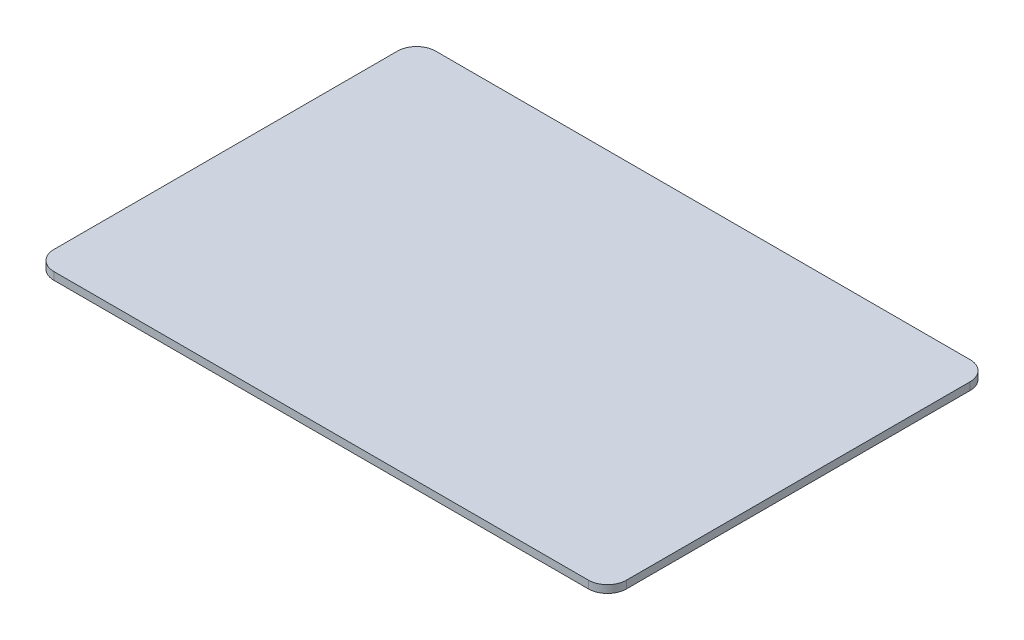
ISO-10303-21;
HEADER;
FILE_DESCRIPTION(('STEP AP214'),'2;1');
FILE_NAME('part.step','',(''),(''),'','','');
FILE_SCHEMA(('AUTOMOTIVE_DESIGN { 1 0 10303 214 1 1 1 1 }'));
ENDSEC;
DATA;
#1=APPLICATION_CONTEXT('core data for automotive mechanical design processes');
#2=APPLICATION_PROTOCOL_DEFINITION('international standard','automotive_design',2000,#1);
#3=PRODUCT_CONTEXT('',#1,'mechanical');
#4=PRODUCT('Part','Part','',(#3));
#5=PRODUCT_RELATED_PRODUCT_CATEGORY('part','',(#4));
#6=PRODUCT_DEFINITION_FORMATION('','',#4);
#7=PRODUCT_DEFINITION_CONTEXT('part definition',#1,'design');
#8=PRODUCT_DEFINITION('design','',#6,#7);
#9=PRODUCT_DEFINITION_SHAPE('','',#8);
#10=(LENGTH_UNIT() NAMED_UNIT(*) SI_UNIT(.MILLI.,.METRE.));
#11=(NAMED_UNIT(*) PLANE_ANGLE_UNIT() SI_UNIT($,.RADIAN.));
#12=(NAMED_UNIT(*) SI_UNIT($,.STERADIAN.) SOLID_ANGLE_UNIT());
#13=UNCERTAINTY_MEASURE_WITH_UNIT(LENGTH_MEASURE(1.E-05),#10,'distance_accuracy_value','');
#14=(GEOMETRIC_REPRESENTATION_CONTEXT(3) GLOBAL_UNCERTAINTY_ASSIGNED_CONTEXT((#13)) GLOBAL_UNIT_ASSIGNED_CONTEXT((#10,
#11,#12)) REPRESENTATION_CONTEXT('',''));
#15=CARTESIAN_POINT('',(0.,0.,0.));
#16=DIRECTION('',(0.,0.,1.));
#17=DIRECTION('',(1.,0.,0.));
#18=AXIS2_PLACEMENT_3D('',#15,#16,#17);
#19=CARTESIAN_POINT('',(140.,4.,90.));
#20=DIRECTION('',(0.,-1.,0.));
#21=DIRECTION('',(0.,0.,-1.));
#22=AXIS2_PLACEMENT_3D('',#19,#20,#21);
#23=CYLINDRICAL_SURFACE('',#22,10.);
#24=CARTESIAN_POINT('',(140.,0.,90.));
#25=DIRECTION('',(0.,1.,0.));
#26=DIRECTION('',(0.,0.,1.));
#27=AXIS2_PLACEMENT_3D('',#24,#25,#26);
#28=CIRCLE('',#27,10.);
#29=CARTESIAN_POINT('',(140.,0.,100.));
#30=VERTEX_POINT('',#29);
#31=CARTESIAN_POINT('',(150.,0.,90.));
#32=VERTEX_POINT('',#31);
#33=EDGE_CURVE('E133',#30,#32,#28,.T.);
#34=ORIENTED_EDGE('',*,*,#33,.T.);
#35=DIRECTION('',(0.,-1.,0.));
#36=VECTOR('',#35,1.);
#37=CARTESIAN_POINT('',(150.,4.,90.));
#38=LINE('',#37,#36);
#39=CARTESIAN_POINT('',(150.,4.,90.));
#40=VERTEX_POINT('',#39);
#41=EDGE_CURVE('E11',#40,#32,#38,.T.);
#42=ORIENTED_EDGE('',*,*,#41,.F.);
#43=CARTESIAN_POINT('',(140.,4.,90.));
#44=DIRECTION('',(0.,1.,0.));
#45=DIRECTION('',(0.,0.,1.));
#46=AXIS2_PLACEMENT_3D('',#43,#44,#45);
#47=CIRCLE('',#46,10.);
#48=CARTESIAN_POINT('',(140.,4.,100.));
#49=VERTEX_POINT('',#48);
#50=EDGE_CURVE('E147',#49,#40,#47,.T.);
#51=ORIENTED_EDGE('',*,*,#50,.F.);
#52=DIRECTION('',(0.,-1.,0.));
#53=VECTOR('',#52,1.);
#54=CARTESIAN_POINT('',(140.,4.,100.));
#55=LINE('',#54,#53);
#56=EDGE_CURVE('E129',#49,#30,#55,.T.);
#57=ORIENTED_EDGE('',*,*,#56,.T.);
#58=EDGE_LOOP('',(#34,#42,#51,#57));
#59=FACE_BOUND('',#58,.T.);
#60=ADVANCED_FACE('F37',(#59),#23,.T.);
#61=CARTESIAN_POINT('',(150.,4.,90.));
#62=DIRECTION('',(-1.,0.,0.));
#63=DIRECTION('',(0.,0.,1.));
#64=AXIS2_PLACEMENT_3D('',#61,#62,#63);
#65=PLANE('',#64);
#66=DIRECTION('',(0.,0.,-1.));
#67=VECTOR('',#66,1.);
#68=CARTESIAN_POINT('',(150.,0.,90.));
#69=LINE('',#68,#67);
#70=CARTESIAN_POINT('',(150.,0.,-90.));
#71=VERTEX_POINT('',#70);
#72=EDGE_CURVE('E136',#32,#71,#69,.T.);
#73=ORIENTED_EDGE('',*,*,#72,.T.);
#74=DIRECTION('',(0.,-1.,0.));
#75=VECTOR('',#74,1.);
#76=CARTESIAN_POINT('',(150.,4.,-90.));
#77=LINE('',#76,#75);
#78=CARTESIAN_POINT('',(150.,4.,-90.));
#79=VERTEX_POINT('',#78);
#80=EDGE_CURVE('E45',#79,#71,#77,.T.);
#81=ORIENTED_EDGE('',*,*,#80,.F.);
#82=DIRECTION('',(0.,0.,-1.));
#83=VECTOR('',#82,1.);
#84=CARTESIAN_POINT('',(150.,4.,90.));
#85=LINE('',#84,#83);
#86=EDGE_CURVE('E96',#40,#79,#85,.T.);
#87=ORIENTED_EDGE('',*,*,#86,.F.);
#88=ORIENTED_EDGE('',*,*,#41,.T.);
#89=EDGE_LOOP('',(#73,#81,#87,#88));
#90=FACE_BOUND('',#89,.T.);
#91=ADVANCED_FACE('F182',(#90),#65,.F.);
#92=CARTESIAN_POINT('',(140.,4.,-90.));
#93=DIRECTION('',(0.,-1.,0.));
#94=DIRECTION('',(0.,0.,-1.));
#95=AXIS2_PLACEMENT_3D('',#92,#93,#94);
#96=CYLINDRICAL_SURFACE('',#95,10.);
#97=CARTESIAN_POINT('',(140.,0.,-90.));
#98=DIRECTION('',(0.,1.,0.));
#99=DIRECTION('',(0.,0.,1.));
#100=AXIS2_PLACEMENT_3D('',#97,#98,#99);
#101=CIRCLE('',#100,10.);
#102=CARTESIAN_POINT('',(140.,0.,-100.));
#103=VERTEX_POINT('',#102);
#104=EDGE_CURVE('E138',#71,#103,#101,.T.);
#105=ORIENTED_EDGE('',*,*,#104,.T.);
#106=DIRECTION('',(0.,-1.,0.));
#107=VECTOR('',#106,1.);
#108=CARTESIAN_POINT('',(140.,4.,-100.));
#109=LINE('',#108,#107);
#110=CARTESIAN_POINT('',(140.,4.,-100.));
#111=VERTEX_POINT('',#110);
#112=EDGE_CURVE('E154',#111,#103,#109,.T.);
#113=ORIENTED_EDGE('',*,*,#112,.F.);
#114=CARTESIAN_POINT('',(140.,4.,-90.));
#115=DIRECTION('',(0.,1.,0.));
#116=DIRECTION('',(0.,0.,1.));
#117=AXIS2_PLACEMENT_3D('',#114,#115,#116);
#118=CIRCLE('',#117,10.);
#119=EDGE_CURVE('E162',#79,#111,#118,.T.);
#120=ORIENTED_EDGE('',*,*,#119,.F.);
#121=ORIENTED_EDGE('',*,*,#80,.T.);
#122=EDGE_LOOP('',(#105,#113,#120,#121));
#123=FACE_BOUND('',#122,.T.);
#124=ADVANCED_FACE('F160',(#123),#96,.T.);
#125=CARTESIAN_POINT('',(140.,4.,-100.));
#126=DIRECTION('',(0.,0.,1.));
#127=DIRECTION('',(1.,0.,0.));
#128=AXIS2_PLACEMENT_3D('',#125,#126,#127);
#129=PLANE('',#128);
#130=DIRECTION('',(-1.,0.,0.));
#131=VECTOR('',#130,1.);
#132=CARTESIAN_POINT('',(140.,0.,-100.));
#133=LINE('',#132,#131);
#134=CARTESIAN_POINT('',(-140.,0.,-100.));
#135=VERTEX_POINT('',#134);
#136=EDGE_CURVE('E140',#103,#135,#133,.T.);
#137=ORIENTED_EDGE('',*,*,#136,.T.);
#138=DIRECTION('',(0.,-1.,0.));
#139=VECTOR('',#138,1.);
#140=CARTESIAN_POINT('',(-140.,4.,-100.));
#141=LINE('',#140,#139);
#142=CARTESIAN_POINT('',(-140.,4.,-100.));
#143=VERTEX_POINT('',#142);
#144=EDGE_CURVE('E151',#143,#135,#141,.T.);
#145=ORIENTED_EDGE('',*,*,#144,.F.);
#146=DIRECTION('',(-1.,0.,0.));
#147=VECTOR('',#146,1.);
#148=CARTESIAN_POINT('',(140.,4.,-100.));
#149=LINE('',#148,#147);
#150=EDGE_CURVE('E174',#111,#143,#149,.T.);
#151=ORIENTED_EDGE('',*,*,#150,.F.);
#152=ORIENTED_EDGE('',*,*,#112,.T.);
#153=EDGE_LOOP('',(#137,#145,#151,#152));
#154=FACE_BOUND('',#153,.T.);
#155=ADVANCED_FACE('F170',(#154),#129,.F.);
#156=CARTESIAN_POINT('',(-140.,4.,-90.));
#157=DIRECTION('',(0.,-1.,0.));
#158=DIRECTION('',(0.,0.,-1.));
#159=AXIS2_PLACEMENT_3D('',#156,#157,#158);
#160=CYLINDRICAL_SURFACE('',#159,10.);
#161=CARTESIAN_POINT('',(-140.,0.,-90.));
#162=DIRECTION('',(0.,1.,0.));
#163=DIRECTION('',(0.,0.,1.));
#164=AXIS2_PLACEMENT_3D('',#161,#162,#163);
#165=CIRCLE('',#164,10.);
#166=CARTESIAN_POINT('',(-150.,0.,-90.));
#167=VERTEX_POINT('',#166);
#168=EDGE_CURVE('E142',#135,#167,#165,.T.);
#169=ORIENTED_EDGE('',*,*,#168,.T.);
#170=DIRECTION('',(0.,-1.,0.));
#171=VECTOR('',#170,1.);
#172=CARTESIAN_POINT('',(-150.,4.,-90.));
#173=LINE('',#172,#171);
#174=CARTESIAN_POINT('',(-150.,4.,-90.));
#175=VERTEX_POINT('',#174);
#176=EDGE_CURVE('E124',#175,#167,#173,.T.);
#177=ORIENTED_EDGE('',*,*,#176,.F.);
#178=CARTESIAN_POINT('',(-140.,4.,-90.));
#179=DIRECTION('',(0.,1.,0.));
#180=DIRECTION('',(0.,0.,1.));
#181=AXIS2_PLACEMENT_3D('',#178,#179,#180);
#182=CIRCLE('',#181,10.);
#183=EDGE_CURVE('E115',#143,#175,#182,.T.);
#184=ORIENTED_EDGE('',*,*,#183,.F.);
#185=ORIENTED_EDGE('',*,*,#144,.T.);
#186=EDGE_LOOP('',(#169,#177,#184,#185));
#187=FACE_BOUND('',#186,.T.);
#188=ADVANCED_FACE('F173',(#187),#160,.T.);
#189=CARTESIAN_POINT('',(-150.,4.,90.0000000000001));
#190=DIRECTION('',(1.,0.,0.));
#191=DIRECTION('',(0.,0.,-1.));
#192=AXIS2_PLACEMENT_3D('',#189,#190,#191);
#193=PLANE('',#192);
#194=DIRECTION('',(0.,0.,1.));
#195=VECTOR('',#194,1.);
#196=CARTESIAN_POINT('',(-150.,0.,90.0000000000001));
#197=LINE('',#196,#195);
#198=CARTESIAN_POINT('',(-150.,0.,90.0000000000001));
#199=VERTEX_POINT('',#198);
#200=EDGE_CURVE('E123',#167,#199,#197,.T.);
#201=ORIENTED_EDGE('',*,*,#200,.T.);
#202=DIRECTION('',(0.,-1.,0.));
#203=VECTOR('',#202,1.);
#204=CARTESIAN_POINT('',(-150.,4.,90.0000000000001));
#205=LINE('',#204,#203);
#206=CARTESIAN_POINT('',(-150.,4.,90.0000000000001));
#207=VERTEX_POINT('',#206);
#208=EDGE_CURVE('E120',#207,#199,#205,.T.);
#209=ORIENTED_EDGE('',*,*,#208,.F.);
#210=DIRECTION('',(0.,0.,1.));
#211=VECTOR('',#210,1.);
#212=CARTESIAN_POINT('',(-150.,4.,90.0000000000001));
#213=LINE('',#212,#211);
#214=EDGE_CURVE('E109',#175,#207,#213,.T.);
#215=ORIENTED_EDGE('',*,*,#214,.F.);
#216=ORIENTED_EDGE('',*,*,#176,.T.);
#217=EDGE_LOOP('',(#201,#209,#215,#216));
#218=FACE_BOUND('',#217,.T.);
#219=ADVANCED_FACE('F121',(#218),#193,.F.);
#220=CARTESIAN_POINT('',(-140.,4.,90.0000000000001));
#221=DIRECTION('',(0.,-1.,0.));
#222=DIRECTION('',(0.,0.,-1.));
#223=AXIS2_PLACEMENT_3D('',#220,#221,#222);
#224=CYLINDRICAL_SURFACE('',#223,10.);
#225=CARTESIAN_POINT('',(-140.,0.,90.0000000000001));
#226=DIRECTION('',(0.,1.,0.));
#227=DIRECTION('',(0.,0.,-1.));
#228=AXIS2_PLACEMENT_3D('',#225,#226,#227);
#229=CIRCLE('',#228,10.);
#230=CARTESIAN_POINT('',(-140.,0.,100.));
#231=VERTEX_POINT('',#230);
#232=EDGE_CURVE('E82',#199,#231,#229,.T.);
#233=ORIENTED_EDGE('',*,*,#232,.T.);
#234=DIRECTION('',(0.,-1.,0.));
#235=VECTOR('',#234,1.);
#236=CARTESIAN_POINT('',(-140.,4.,100.));
#237=LINE('',#236,#235);
#238=CARTESIAN_POINT('',(-140.,4.,100.));
#239=VERTEX_POINT('',#238);
#240=EDGE_CURVE('E125',#239,#231,#237,.T.);
#241=ORIENTED_EDGE('',*,*,#240,.F.);
#242=CARTESIAN_POINT('',(-140.,4.,90.0000000000001));
#243=DIRECTION('',(0.,1.,0.));
#244=DIRECTION('',(0.,0.,-1.));
#245=AXIS2_PLACEMENT_3D('',#242,#243,#244);
#246=CIRCLE('',#245,10.);
#247=EDGE_CURVE('E113',#207,#239,#246,.T.);
#248=ORIENTED_EDGE('',*,*,#247,.F.);
#249=ORIENTED_EDGE('',*,*,#208,.T.);
#250=EDGE_LOOP('',(#233,#241,#248,#249));
#251=FACE_BOUND('',#250,.T.);
#252=ADVANCED_FACE('F127',(#251),#224,.T.);
#253=CARTESIAN_POINT('',(140.,4.,100.));
#254=DIRECTION('',(0.,0.,-1.));
#255=DIRECTION('',(-1.,0.,0.));
#256=AXIS2_PLACEMENT_3D('',#253,#254,#255);
#257=PLANE('',#256);
#258=DIRECTION('',(1.,0.,0.));
#259=VECTOR('',#258,1.);
#260=CARTESIAN_POINT('',(140.,0.,100.));
#261=LINE('',#260,#259);
#262=EDGE_CURVE('E88',#231,#30,#261,.T.);
#263=ORIENTED_EDGE('',*,*,#262,.T.);
#264=ORIENTED_EDGE('',*,*,#56,.F.);
#265=DIRECTION('',(1.,0.,0.));
#266=VECTOR('',#265,1.);
#267=CARTESIAN_POINT('',(140.,4.,100.));
#268=LINE('',#267,#266);
#269=EDGE_CURVE('E53',#239,#49,#268,.T.);
#270=ORIENTED_EDGE('',*,*,#269,.F.);
#271=ORIENTED_EDGE('',*,*,#240,.T.);
#272=EDGE_LOOP('',(#263,#264,#270,#271));
#273=FACE_BOUND('',#272,.T.);
#274=ADVANCED_FACE('F198',(#273),#257,.F.);
#275=CARTESIAN_POINT('',(140.,4.,90.));
#276=DIRECTION('',(0.,1.,0.));
#277=DIRECTION('',(0.,0.,1.));
#278=AXIS2_PLACEMENT_3D('',#275,#276,#277);
#279=PLANE('',#278);
#280=ORIENTED_EDGE('',*,*,#50,.T.);
#281=ORIENTED_EDGE('',*,*,#86,.T.);
#282=ORIENTED_EDGE('',*,*,#119,.T.);
#283=ORIENTED_EDGE('',*,*,#150,.T.);
#284=ORIENTED_EDGE('',*,*,#183,.T.);
#285=ORIENTED_EDGE('',*,*,#214,.T.);
#286=ORIENTED_EDGE('',*,*,#247,.T.);
#287=ORIENTED_EDGE('',*,*,#269,.T.);
#288=EDGE_LOOP('',(#280,#281,#282,#283,#284,#285,#286,#287));
#289=FACE_BOUND('',#288,.T.);
#290=ADVANCED_FACE('F111',(#289),#279,.T.);
#291=CARTESIAN_POINT('',(140.,0.,90.));
#292=DIRECTION('',(0.,1.,0.));
#293=DIRECTION('',(0.,0.,1.));
#294=AXIS2_PLACEMENT_3D('',#291,#292,#293);
#295=PLANE('',#294);
#296=ORIENTED_EDGE('',*,*,#33,.F.);
#297=ORIENTED_EDGE('',*,*,#262,.F.);
#298=ORIENTED_EDGE('',*,*,#232,.F.);
#299=ORIENTED_EDGE('',*,*,#200,.F.);
#300=ORIENTED_EDGE('',*,*,#168,.F.);
#301=ORIENTED_EDGE('',*,*,#136,.F.);
#302=ORIENTED_EDGE('',*,*,#104,.F.);
#303=ORIENTED_EDGE('',*,*,#72,.F.);
#304=EDGE_LOOP('',(#296,#297,#298,#299,#300,#301,#302,#303));
#305=FACE_BOUND('',#304,.T.);
#306=ADVANCED_FACE('F166',(#305),#295,.F.);
#307=CLOSED_SHELL('',(#60,#91,#124,#155,#188,#219,#252,#274,#290,#306));
#308=MANIFOLD_SOLID_BREP('B2',#307);
#309=ADVANCED_BREP_SHAPE_REPRESENTATION('',(#18,#308),#14);
#310=SHAPE_DEFINITION_REPRESENTATION(#9,#309);
ENDSEC;
END-ISO-10303-21;
